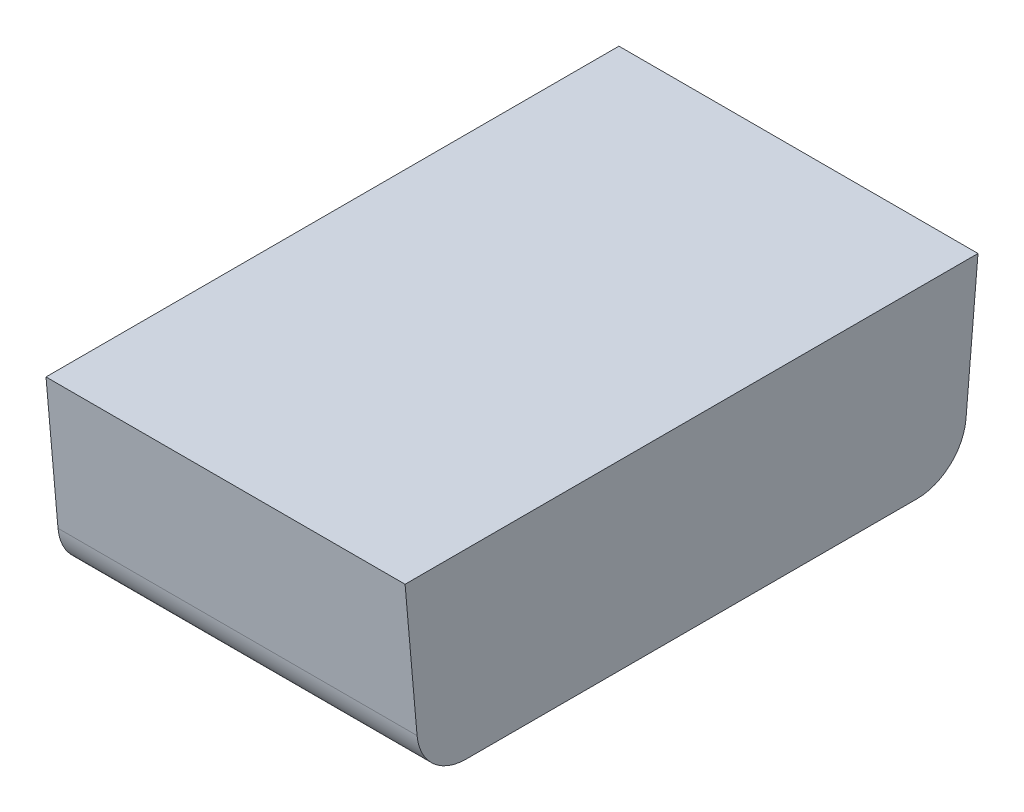
ISO-10303-21;
HEADER;
FILE_DESCRIPTION(('STEP AP214'),'2;1');
FILE_NAME('part.step','',(''),(''),'','','');
FILE_SCHEMA(('AUTOMOTIVE_DESIGN { 1 0 10303 214 1 1 1 1 }'));
ENDSEC;
DATA;
#1=APPLICATION_CONTEXT('core data for automotive mechanical design processes');
#2=APPLICATION_PROTOCOL_DEFINITION('international standard','automotive_design',2000,#1);
#3=PRODUCT_CONTEXT('',#1,'mechanical');
#4=PRODUCT('Part','Part','',(#3));
#5=PRODUCT_RELATED_PRODUCT_CATEGORY('part','',(#4));
#6=PRODUCT_DEFINITION_FORMATION('','',#4);
#7=PRODUCT_DEFINITION_CONTEXT('part definition',#1,'design');
#8=PRODUCT_DEFINITION('design','',#6,#7);
#9=PRODUCT_DEFINITION_SHAPE('','',#8);
#10=(LENGTH_UNIT() NAMED_UNIT(*) SI_UNIT(.MILLI.,.METRE.));
#11=(NAMED_UNIT(*) PLANE_ANGLE_UNIT() SI_UNIT($,.RADIAN.));
#12=(NAMED_UNIT(*) SI_UNIT($,.STERADIAN.) SOLID_ANGLE_UNIT());
#13=UNCERTAINTY_MEASURE_WITH_UNIT(LENGTH_MEASURE(1.E-05),#10,'distance_accuracy_value','');
#14=(GEOMETRIC_REPRESENTATION_CONTEXT(3) GLOBAL_UNCERTAINTY_ASSIGNED_CONTEXT((#13)) GLOBAL_UNIT_ASSIGNED_CONTEXT((#10,
#11,#12)) REPRESENTATION_CONTEXT('',''));
#15=CARTESIAN_POINT('',(0.,0.,0.));
#16=DIRECTION('',(0.,0.,1.));
#17=DIRECTION('',(1.,0.,0.));
#18=AXIS2_PLACEMENT_3D('',#15,#16,#17);
#19=CARTESIAN_POINT('',(1.91,-1.3,-31.0416331174));
#20=DIRECTION('',(-1.,0.,0.));
#21=DIRECTION('',(0.,0.,1.));
#22=AXIS2_PLACEMENT_3D('',#19,#20,#21);
#23=CYLINDRICAL_SURFACE('',#22,0.0999999999999998);
#24=CARTESIAN_POINT('',(1.91,-1.3,-31.0416331174));
#25=DIRECTION('',(-1.,0.,0.));
#26=DIRECTION('',(0.,0.,1.));
#27=AXIS2_PLACEMENT_3D('',#24,#25,#26);
#28=CIRCLE('',#27,0.0999999999999998);
#29=CARTESIAN_POINT('',(1.91,-1.30871557427365,-30.9420136475899));
#30=VERTEX_POINT('',#29);
#31=CARTESIAN_POINT('',(1.91,-1.4,-31.0416331174));
#32=VERTEX_POINT('',#31);
#33=EDGE_CURVE('E21',#30,#32,#28,.F.);
#34=ORIENTED_EDGE('',*,*,#33,.F.);
#35=DIRECTION('',(1.,0.,0.));
#36=VECTOR('',#35,1.);
#37=CARTESIAN_POINT('',(1.545,-1.308715574275,-30.94201364759));
#38=LINE('',#37,#36);
#39=CARTESIAN_POINT('',(1.18,-1.30871557427458,-30.9420136475934));
#40=VERTEX_POINT('',#39);
#41=EDGE_CURVE('E61',#40,#30,#38,.T.);
#42=ORIENTED_EDGE('',*,*,#41,.F.);
#43=CARTESIAN_POINT('',(1.18,-1.3,-31.0416331174));
#44=DIRECTION('',(-1.,0.,0.));
#45=DIRECTION('',(0.,0.,1.));
#46=AXIS2_PLACEMENT_3D('',#43,#44,#45);
#47=CIRCLE('',#46,0.0999999999999998);
#48=CARTESIAN_POINT('',(1.18,-1.4,-31.0416331174));
#49=VERTEX_POINT('',#48);
#50=EDGE_CURVE('E84',#49,#40,#47,.T.);
#51=ORIENTED_EDGE('',*,*,#50,.F.);
#52=DIRECTION('',(-1.,0.,0.));
#53=VECTOR('',#52,1.);
#54=CARTESIAN_POINT('',(1.545,-1.4,-31.0416331174));
#55=LINE('',#54,#53);
#56=EDGE_CURVE('E74',#32,#49,#55,.T.);
#57=ORIENTED_EDGE('',*,*,#56,.F.);
#58=EDGE_LOOP('',(#34,#42,#51,#57));
#59=FACE_BOUND('',#58,.T.);
#60=ADVANCED_FACE('F17',(#59),#23,.T.);
#61=CARTESIAN_POINT('',(1.18,-1.3,-31.9583668826));
#62=DIRECTION('',(1.,0.,0.));
#63=DIRECTION('',(0.,0.,-1.));
#64=AXIS2_PLACEMENT_3D('',#61,#62,#63);
#65=CYLINDRICAL_SURFACE('',#64,0.0999999999999998);
#66=CARTESIAN_POINT('',(1.18,-1.3,-31.9583668826));
#67=DIRECTION('',(1.,0.,0.));
#68=DIRECTION('',(0.,0.,-1.));
#69=AXIS2_PLACEMENT_3D('',#66,#67,#68);
#70=CIRCLE('',#69,0.0999999999999998);
#71=CARTESIAN_POINT('',(1.18,-1.30871557427469,-32.0579863524061));
#72=VERTEX_POINT('',#71);
#73=CARTESIAN_POINT('',(1.18,-1.4,-31.9583668826));
#74=VERTEX_POINT('',#73);
#75=EDGE_CURVE('E97',#72,#74,#70,.F.);
#76=ORIENTED_EDGE('',*,*,#75,.F.);
#77=DIRECTION('',(-1.,0.,0.));
#78=VECTOR('',#77,1.);
#79=CARTESIAN_POINT('',(1.545,-1.308715574275,-32.05798635241));
#80=LINE('',#79,#78);
#81=CARTESIAN_POINT('',(1.91,-1.30871557427458,-32.0579863524066));
#82=VERTEX_POINT('',#81);
#83=EDGE_CURVE('E79',#82,#72,#80,.T.);
#84=ORIENTED_EDGE('',*,*,#83,.F.);
#85=CARTESIAN_POINT('',(1.91,-1.3,-31.9583668826));
#86=DIRECTION('',(1.,0.,0.));
#87=DIRECTION('',(0.,0.,-1.));
#88=AXIS2_PLACEMENT_3D('',#85,#86,#87);
#89=CIRCLE('',#88,0.0999999999999998);
#90=CARTESIAN_POINT('',(1.91,-1.4,-31.9583668826));
#91=VERTEX_POINT('',#90);
#92=EDGE_CURVE('E105',#91,#82,#89,.T.);
#93=ORIENTED_EDGE('',*,*,#92,.F.);
#94=DIRECTION('',(1.,0.,0.));
#95=VECTOR('',#94,1.);
#96=CARTESIAN_POINT('',(1.545,-1.4,-31.9583668826));
#97=LINE('',#96,#95);
#98=EDGE_CURVE('E111',#74,#91,#97,.T.);
#99=ORIENTED_EDGE('',*,*,#98,.F.);
#100=EDGE_LOOP('',(#76,#84,#93,#99));
#101=FACE_BOUND('',#100,.T.);
#102=ADVANCED_FACE('F130',(#101),#65,.T.);
#103=CARTESIAN_POINT('',(1.18,-1.4,-31.9583668826));
#104=DIRECTION('',(0.,-1.,0.));
#105=DIRECTION('',(1.,0.,0.));
#106=AXIS2_PLACEMENT_3D('',#103,#104,#105);
#107=PLANE('',#106);
#108=ORIENTED_EDGE('',*,*,#98,.T.);
#109=DIRECTION('',(0.,0.,-1.));
#110=VECTOR('',#109,1.);
#111=CARTESIAN_POINT('',(1.91,-1.4,-31.5));
#112=LINE('',#111,#110);
#113=EDGE_CURVE('E78',#32,#91,#112,.T.);
#114=ORIENTED_EDGE('',*,*,#113,.F.);
#115=ORIENTED_EDGE('',*,*,#56,.T.);
#116=DIRECTION('',(0.,0.,1.));
#117=VECTOR('',#116,1.);
#118=CARTESIAN_POINT('',(1.18,-1.4,-31.5));
#119=LINE('',#118,#117);
#120=EDGE_CURVE('E100',#74,#49,#119,.T.);
#121=ORIENTED_EDGE('',*,*,#120,.F.);
#122=EDGE_LOOP('',(#108,#114,#115,#121));
#123=FACE_BOUND('',#122,.T.);
#124=ADVANCED_FACE('F133',(#123),#107,.T.);
#125=CARTESIAN_POINT('',(1.18,-1.03,-32.0823708055));
#126=DIRECTION('',(0.,-0.0871557427222083,-0.996194698093972));
#127=DIRECTION('',(1.,0.,0.));
#128=AXIS2_PLACEMENT_3D('',#125,#126,#127);
#129=PLANE('',#128);
#130=DIRECTION('',(1.,0.,0.));
#131=VECTOR('',#130,1.);
#132=CARTESIAN_POINT('',(1.545,-1.03,-32.0823708055));
#133=LINE('',#132,#131);
#134=CARTESIAN_POINT('',(1.18,-1.03,-32.0823708055));
#135=VERTEX_POINT('',#134);
#136=CARTESIAN_POINT('',(1.91,-1.03,-32.0823708055));
#137=VERTEX_POINT('',#136);
#138=EDGE_CURVE('E94',#135,#137,#133,.T.);
#139=ORIENTED_EDGE('',*,*,#138,.T.);
#140=DIRECTION('',(0.,0.996194698091811,-0.0871557427469079));
#141=VECTOR('',#140,1.);
#142=CARTESIAN_POINT('',(1.91,-1.3087155742748,-32.0579863524031));
#143=LINE('',#142,#141);
#144=EDGE_CURVE('E70',#82,#137,#143,.T.);
#145=ORIENTED_EDGE('',*,*,#144,.F.);
#146=ORIENTED_EDGE('',*,*,#83,.T.);
#147=DIRECTION('',(0.,-0.996194698091546,0.0871557427499353));
#148=VECTOR('',#147,1.);
#149=CARTESIAN_POINT('',(1.18,-1.03,-32.0823708055));
#150=LINE('',#149,#148);
#151=EDGE_CURVE('E101',#135,#72,#150,.T.);
#152=ORIENTED_EDGE('',*,*,#151,.F.);
#153=EDGE_LOOP('',(#139,#145,#146,#152));
#154=FACE_BOUND('',#153,.T.);
#155=ADVANCED_FACE('F128',(#154),#129,.T.);
#156=CARTESIAN_POINT('',(1.91,-1.03,-32.0823708055));
#157=DIRECTION('',(1.,0.,0.));
#158=DIRECTION('',(0.,0.,1.));
#159=AXIS2_PLACEMENT_3D('',#156,#157,#158);
#160=PLANE('',#159);
#161=DIRECTION('',(0.,0.,1.));
#162=VECTOR('',#161,1.);
#163=CARTESIAN_POINT('',(1.91,-1.03,-31.5));
#164=LINE('',#163,#162);
#165=CARTESIAN_POINT('',(1.91,-1.03,-30.9176291945));
#166=VERTEX_POINT('',#165);
#167=EDGE_CURVE('E83',#137,#166,#164,.T.);
#168=ORIENTED_EDGE('',*,*,#167,.T.);
#169=DIRECTION('',(0.,0.996194698093972,0.0871557427222083));
#170=VECTOR('',#169,1.);
#171=CARTESIAN_POINT('',(1.91,-1.1693577871375,-30.929821421045));
#172=LINE('',#171,#170);
#173=EDGE_CURVE('E66',#30,#166,#172,.T.);
#174=ORIENTED_EDGE('',*,*,#173,.F.);
#175=ORIENTED_EDGE('',*,*,#33,.T.);
#176=ORIENTED_EDGE('',*,*,#113,.T.);
#177=ORIENTED_EDGE('',*,*,#92,.T.);
#178=ORIENTED_EDGE('',*,*,#144,.T.);
#179=EDGE_LOOP('',(#168,#174,#175,#176,#177,#178));
#180=FACE_BOUND('',#179,.T.);
#181=ADVANCED_FACE('F81',(#180),#160,.T.);
#182=CARTESIAN_POINT('',(1.91,-1.03,-30.9176291945));
#183=DIRECTION('',(0.,-0.0871557427222083,0.996194698093972));
#184=DIRECTION('',(-1.,0.,0.));
#185=AXIS2_PLACEMENT_3D('',#182,#183,#184);
#186=PLANE('',#185);
#187=DIRECTION('',(-1.,0.,0.));
#188=VECTOR('',#187,1.);
#189=CARTESIAN_POINT('',(1.545,-1.03,-30.9176291945));
#190=LINE('',#189,#188);
#191=CARTESIAN_POINT('',(1.18,-1.03,-30.9176291945));
#192=VERTEX_POINT('',#191);
#193=EDGE_CURVE('E27',#166,#192,#190,.T.);
#194=ORIENTED_EDGE('',*,*,#193,.T.);
#195=DIRECTION('',(0.,0.996194698091809,0.0871557427469325));
#196=VECTOR('',#195,1.);
#197=CARTESIAN_POINT('',(1.18,-1.3087155742748,-30.942013647597));
#198=LINE('',#197,#196);
#199=EDGE_CURVE('E35',#40,#192,#198,.T.);
#200=ORIENTED_EDGE('',*,*,#199,.F.);
#201=ORIENTED_EDGE('',*,*,#41,.T.);
#202=ORIENTED_EDGE('',*,*,#173,.T.);
#203=EDGE_LOOP('',(#194,#200,#201,#202));
#204=FACE_BOUND('',#203,.T.);
#205=ADVANCED_FACE('F64',(#204),#186,.T.);
#206=CARTESIAN_POINT('',(1.18,-1.03,-30.9176291945));
#207=DIRECTION('',(-1.,0.,0.));
#208=DIRECTION('',(0.,0.,-1.));
#209=AXIS2_PLACEMENT_3D('',#206,#207,#208);
#210=PLANE('',#209);
#211=ORIENTED_EDGE('',*,*,#75,.T.);
#212=ORIENTED_EDGE('',*,*,#120,.T.);
#213=ORIENTED_EDGE('',*,*,#50,.T.);
#214=ORIENTED_EDGE('',*,*,#199,.T.);
#215=DIRECTION('',(0.,0.,-1.));
#216=VECTOR('',#215,1.);
#217=CARTESIAN_POINT('',(1.18,-1.03,-31.5));
#218=LINE('',#217,#216);
#219=EDGE_CURVE('E11',#192,#135,#218,.T.);
#220=ORIENTED_EDGE('',*,*,#219,.T.);
#221=ORIENTED_EDGE('',*,*,#151,.T.);
#222=EDGE_LOOP('',(#211,#212,#213,#214,#220,#221));
#223=FACE_BOUND('',#222,.T.);
#224=ADVANCED_FACE('F120',(#223),#210,.T.);
#225=CARTESIAN_POINT('',(1.18,-1.03,-32.0823708055));
#226=DIRECTION('',(0.,-1.,0.));
#227=DIRECTION('',(1.,0.,0.));
#228=AXIS2_PLACEMENT_3D('',#225,#226,#227);
#229=PLANE('',#228);
#230=ORIENTED_EDGE('',*,*,#193,.F.);
#231=ORIENTED_EDGE('',*,*,#167,.F.);
#232=ORIENTED_EDGE('',*,*,#138,.F.);
#233=ORIENTED_EDGE('',*,*,#219,.F.);
#234=EDGE_LOOP('',(#230,#231,#232,#233));
#235=FACE_BOUND('',#234,.T.);
#236=ADVANCED_FACE('F19',(#235),#229,.F.);
#237=CLOSED_SHELL('',(#60,#102,#124,#155,#181,#205,#224,#236));
#238=MANIFOLD_SOLID_BREP('B1',#237);
#239=ADVANCED_BREP_SHAPE_REPRESENTATION('',(#18,#238),#14);
#240=SHAPE_DEFINITION_REPRESENTATION(#9,#239);
ENDSEC;
END-ISO-10303-21;
